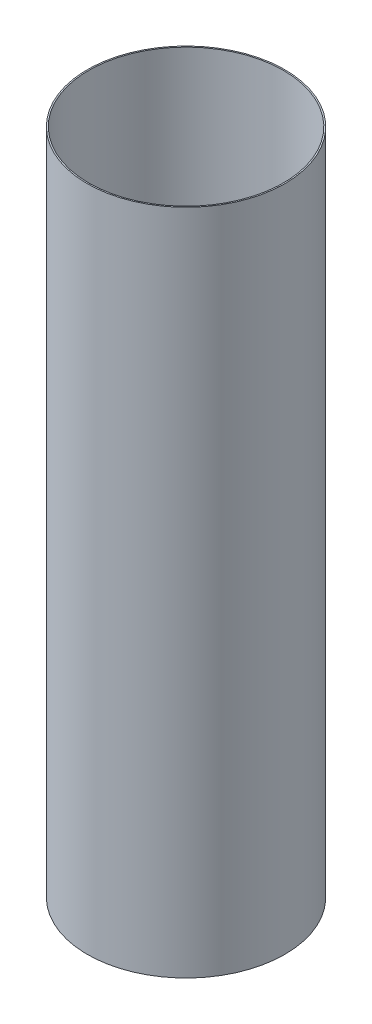
ISO-10303-21;
HEADER;
FILE_DESCRIPTION(('STEP AP214'),'2;1');
FILE_NAME('part.step','',(''),(''),'','','');
FILE_SCHEMA(('AUTOMOTIVE_DESIGN { 1 0 10303 214 1 1 1 1 }'));
ENDSEC;
DATA;
#1=APPLICATION_CONTEXT('core data for automotive mechanical design processes');
#2=APPLICATION_PROTOCOL_DEFINITION('international standard','automotive_design',2000,#1);
#3=PRODUCT_CONTEXT('',#1,'mechanical');
#4=PRODUCT('Part','Part','',(#3));
#5=PRODUCT_RELATED_PRODUCT_CATEGORY('part','',(#4));
#6=PRODUCT_DEFINITION_FORMATION('','',#4);
#7=PRODUCT_DEFINITION_CONTEXT('part definition',#1,'design');
#8=PRODUCT_DEFINITION('design','',#6,#7);
#9=PRODUCT_DEFINITION_SHAPE('','',#8);
#10=(LENGTH_UNIT() NAMED_UNIT(*) SI_UNIT(.MILLI.,.METRE.));
#11=(NAMED_UNIT(*) PLANE_ANGLE_UNIT() SI_UNIT($,.RADIAN.));
#12=(NAMED_UNIT(*) SI_UNIT($,.STERADIAN.) SOLID_ANGLE_UNIT());
#13=UNCERTAINTY_MEASURE_WITH_UNIT(LENGTH_MEASURE(1.E-05),#10,'distance_accuracy_value','');
#14=(GEOMETRIC_REPRESENTATION_CONTEXT(3) GLOBAL_UNCERTAINTY_ASSIGNED_CONTEXT((#13)) GLOBAL_UNIT_ASSIGNED_CONTEXT((#10,
#11,#12)) REPRESENTATION_CONTEXT('',''));
#15=CARTESIAN_POINT('',(0.,0.,0.));
#16=DIRECTION('',(0.,0.,1.));
#17=DIRECTION('',(1.,0.,0.));
#18=AXIS2_PLACEMENT_3D('',#15,#16,#17);
#19=CARTESIAN_POINT('',(0.,250.,0.));
#20=DIRECTION('',(0.,1.,0.));
#21=DIRECTION('',(0.,0.,1.));
#22=AXIS2_PLACEMENT_3D('',#19,#20,#21);
#23=PLANE('',#22);
#24=CARTESIAN_POINT('',(0.,250.,0.));
#25=DIRECTION('',(0.,1.,0.));
#26=DIRECTION('',(1.,0.,0.));
#27=AXIS2_PLACEMENT_3D('',#24,#25,#26);
#28=CIRCLE('',#27,74.);
#29=CARTESIAN_POINT('',(74.,250.,0.));
#30=VERTEX_POINT('',#29);
#31=EDGE_CURVE('E11',#30,#30,#28,.T.);
#32=ORIENTED_EDGE('',*,*,#31,.T.);
#33=EDGE_LOOP('',(#32));
#34=FACE_BOUND('',#33,.T.);
#35=CARTESIAN_POINT('',(0.,250.,0.));
#36=DIRECTION('',(0.,1.,0.));
#37=DIRECTION('',(0.,0.,1.));
#38=AXIS2_PLACEMENT_3D('',#35,#36,#37);
#39=CIRCLE('',#38,73.);
#40=CARTESIAN_POINT('',(0.,250.,73.));
#41=VERTEX_POINT('',#40);
#42=EDGE_CURVE('E48',#41,#41,#39,.T.);
#43=ORIENTED_EDGE('',*,*,#42,.F.);
#44=EDGE_LOOP('',(#43));
#45=FACE_BOUND('',#44,.T.);
#46=ADVANCED_FACE('F37',(#34,#45),#23,.T.);
#47=CARTESIAN_POINT('',(0.,-250.,0.));
#48=DIRECTION('',(0.,1.,0.));
#49=DIRECTION('',(0.,0.,1.));
#50=AXIS2_PLACEMENT_3D('',#47,#48,#49);
#51=PLANE('',#50);
#52=CARTESIAN_POINT('',(0.,-250.,0.));
#53=DIRECTION('',(0.,1.,0.));
#54=DIRECTION('',(1.,0.,0.));
#55=AXIS2_PLACEMENT_3D('',#52,#53,#54);
#56=CIRCLE('',#55,74.);
#57=CARTESIAN_POINT('',(74.,-250.,0.));
#58=VERTEX_POINT('',#57);
#59=EDGE_CURVE('E41',#58,#58,#56,.T.);
#60=ORIENTED_EDGE('',*,*,#59,.F.);
#61=EDGE_LOOP('',(#60));
#62=FACE_BOUND('',#61,.T.);
#63=CARTESIAN_POINT('',(0.,-250.,0.));
#64=DIRECTION('',(0.,1.,0.));
#65=DIRECTION('',(0.,0.,1.));
#66=AXIS2_PLACEMENT_3D('',#63,#64,#65);
#67=CIRCLE('',#66,73.);
#68=CARTESIAN_POINT('',(0.,-250.,73.));
#69=VERTEX_POINT('',#68);
#70=EDGE_CURVE('E50',#69,#69,#67,.T.);
#71=ORIENTED_EDGE('',*,*,#70,.T.);
#72=EDGE_LOOP('',(#71));
#73=FACE_BOUND('',#72,.T.);
#74=ADVANCED_FACE('F60',(#62,#73),#51,.F.);
#75=CARTESIAN_POINT('',(0.,250.,0.));
#76=DIRECTION('',(0.,-1.,0.));
#77=DIRECTION('',(0.,0.,-1.));
#78=AXIS2_PLACEMENT_3D('',#75,#76,#77);
#79=CYLINDRICAL_SURFACE('',#78,74.);
#80=ORIENTED_EDGE('',*,*,#31,.F.);
#81=EDGE_LOOP('',(#80));
#82=FACE_BOUND('',#81,.T.);
#83=ORIENTED_EDGE('',*,*,#59,.T.);
#84=EDGE_LOOP('',(#83));
#85=FACE_BOUND('',#84,.T.);
#86=ADVANCED_FACE('F39',(#82,#85),#79,.T.);
#87=CARTESIAN_POINT('',(0.,250.,0.));
#88=DIRECTION('',(0.,-1.,0.));
#89=DIRECTION('',(0.,0.,-1.));
#90=AXIS2_PLACEMENT_3D('',#87,#88,#89);
#91=CYLINDRICAL_SURFACE('',#90,73.);
#92=ORIENTED_EDGE('',*,*,#42,.T.);
#93=EDGE_LOOP('',(#92));
#94=FACE_BOUND('',#93,.T.);
#95=ORIENTED_EDGE('',*,*,#70,.F.);
#96=EDGE_LOOP('',(#95));
#97=FACE_BOUND('',#96,.T.);
#98=ADVANCED_FACE('F56',(#94,#97),#91,.F.);
#99=CLOSED_SHELL('',(#46,#74,#86,#98));
#100=MANIFOLD_SOLID_BREP('B2',#99);
#101=ADVANCED_BREP_SHAPE_REPRESENTATION('',(#18,#100),#14);
#102=SHAPE_DEFINITION_REPRESENTATION(#9,#101);
ENDSEC;
END-ISO-10303-21;
